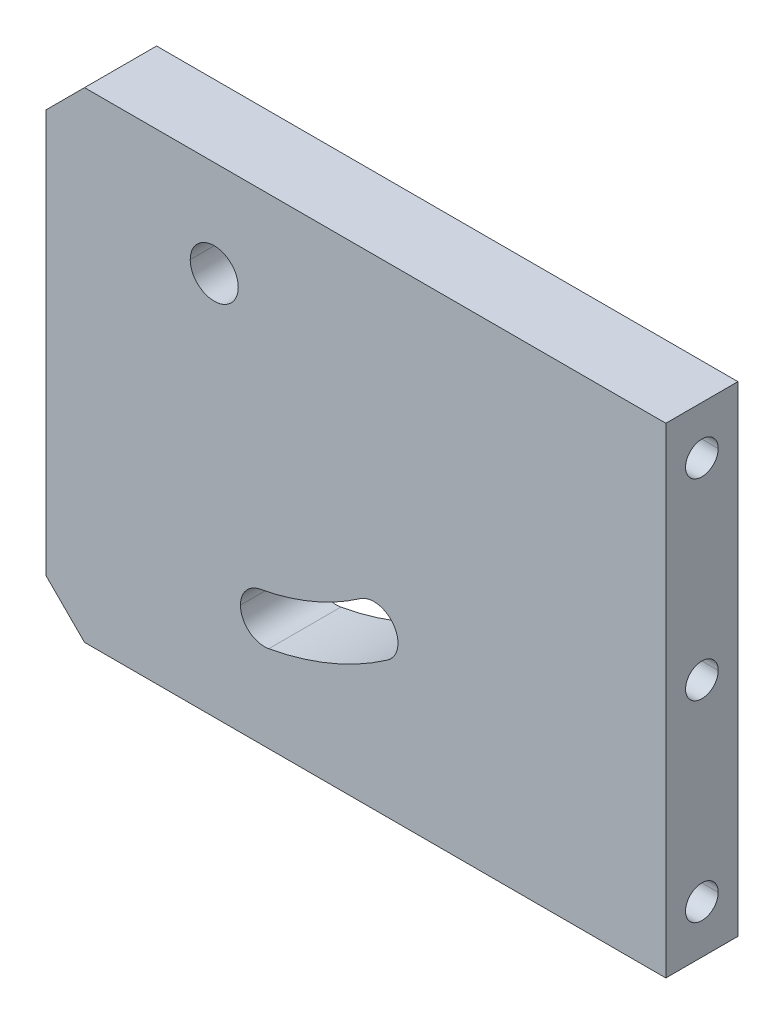
ISO-10303-21;
HEADER;
FILE_DESCRIPTION(('STEP AP214'),'2;1');
FILE_NAME('part.step','',(''),(''),'','','');
FILE_SCHEMA(('AUTOMOTIVE_DESIGN { 1 0 10303 214 1 1 1 1 }'));
ENDSEC;
DATA;
#1=APPLICATION_CONTEXT('core data for automotive mechanical design processes');
#2=APPLICATION_PROTOCOL_DEFINITION('international standard','automotive_design',2000,#1);
#3=PRODUCT_CONTEXT('',#1,'mechanical');
#4=PRODUCT('Part','Part','',(#3));
#5=PRODUCT_RELATED_PRODUCT_CATEGORY('part','',(#4));
#6=PRODUCT_DEFINITION_FORMATION('','',#4);
#7=PRODUCT_DEFINITION_CONTEXT('part definition',#1,'design');
#8=PRODUCT_DEFINITION('design','',#6,#7);
#9=PRODUCT_DEFINITION_SHAPE('','',#8);
#10=(LENGTH_UNIT() NAMED_UNIT(*) SI_UNIT(.MILLI.,.METRE.));
#11=(NAMED_UNIT(*) PLANE_ANGLE_UNIT() SI_UNIT($,.RADIAN.));
#12=(NAMED_UNIT(*) SI_UNIT($,.STERADIAN.) SOLID_ANGLE_UNIT());
#13=UNCERTAINTY_MEASURE_WITH_UNIT(LENGTH_MEASURE(1.E-05),#10,'distance_accuracy_value','');
#14=(GEOMETRIC_REPRESENTATION_CONTEXT(3) GLOBAL_UNCERTAINTY_ASSIGNED_CONTEXT((#13)) GLOBAL_UNIT_ASSIGNED_CONTEXT((#10,
#11,#12)) REPRESENTATION_CONTEXT('',''));
#15=CARTESIAN_POINT('',(0.,0.,0.));
#16=DIRECTION('',(0.,0.,1.));
#17=DIRECTION('',(1.,0.,0.));
#18=AXIS2_PLACEMENT_3D('',#15,#16,#17);
#19=CARTESIAN_POINT('',(64.5,40.,7.5));
#20=DIRECTION('',(1.,0.,0.));
#21=DIRECTION('',(0.,0.,-1.));
#22=AXIS2_PLACEMENT_3D('',#19,#20,#21);
#23=CYLINDRICAL_SURFACE('',#22,3.4);
#24=CARTESIAN_POINT('',(44.5,40.,7.5));
#25=DIRECTION('',(1.,0.,0.));
#26=DIRECTION('',(0.,0.,-1.));
#27=AXIS2_PLACEMENT_3D('',#24,#25,#26);
#28=CIRCLE('',#27,3.4);
#29=CARTESIAN_POINT('',(44.5,40.,10.9));
#30=VERTEX_POINT('',#29);
#31=CARTESIAN_POINT('',(44.5,40.,4.1));
#32=VERTEX_POINT('',#31);
#33=EDGE_CURVE('E41',#30,#32,#28,.T.);
#34=ORIENTED_EDGE('',*,*,#33,.F.);
#35=DIRECTION('',(1.,0.,0.));
#36=VECTOR('',#35,1.);
#37=CARTESIAN_POINT('',(64.5,40.,10.9));
#38=LINE('',#37,#36);
#39=CARTESIAN_POINT('',(64.5,40.,10.9));
#40=VERTEX_POINT('',#39);
#41=EDGE_CURVE('E11',#30,#40,#38,.T.);
#42=ORIENTED_EDGE('',*,*,#41,.T.);
#43=CARTESIAN_POINT('',(64.5,40.,7.5));
#44=DIRECTION('',(1.,0.,0.));
#45=DIRECTION('',(0.,0.,-1.));
#46=AXIS2_PLACEMENT_3D('',#43,#44,#45);
#47=CIRCLE('',#46,3.4);
#48=CARTESIAN_POINT('',(64.5,40.,4.1));
#49=VERTEX_POINT('',#48);
#50=EDGE_CURVE('E28',#40,#49,#47,.T.);
#51=ORIENTED_EDGE('',*,*,#50,.T.);
#52=DIRECTION('',(1.,0.,0.));
#53=VECTOR('',#52,1.);
#54=CARTESIAN_POINT('',(64.5,40.,4.1));
#55=LINE('',#54,#53);
#56=EDGE_CURVE('E302',#32,#49,#55,.T.);
#57=ORIENTED_EDGE('',*,*,#56,.F.);
#58=EDGE_LOOP('',(#34,#42,#51,#57));
#59=FACE_BOUND('',#58,.T.);
#60=ADVANCED_FACE('F18',(#59),#23,.F.);
#61=CARTESIAN_POINT('',(44.5,40.,7.5));
#62=DIRECTION('',(1.,0.,0.));
#63=DIRECTION('',(0.,0.,-1.));
#64=AXIS2_PLACEMENT_3D('',#61,#62,#63);
#65=CONICAL_SURFACE('',#64,3.4,1.02974425867665);
#66=DIRECTION('',(0.515038074910056,0.,-0.857167300702111));
#67=VECTOR('',#66,1.);
#68=CARTESIAN_POINT('',(44.5,40.,4.1));
#69=LINE('',#68,#67);
#70=CARTESIAN_POINT('',(42.4570738953063,40.,7.5));
#71=VERTEX_POINT('',#70);
#72=EDGE_CURVE('E301',#71,#32,#69,.T.);
#73=ORIENTED_EDGE('',*,*,#72,.F.);
#74=DIRECTION('',(0.515038074910056,0.,0.857167300702111));
#75=VECTOR('',#74,1.);
#76=CARTESIAN_POINT('',(44.5,40.,10.9));
#77=LINE('',#76,#75);
#78=EDGE_CURVE('E260',#71,#30,#77,.T.);
#79=ORIENTED_EDGE('',*,*,#78,.T.);
#80=ORIENTED_EDGE('',*,*,#33,.T.);
#81=EDGE_LOOP('',(#73,#79,#80));
#82=FACE_BOUND('',#81,.T.);
#83=ADVANCED_FACE('F470',(#82),#65,.F.);
#84=CARTESIAN_POINT('',(64.5,0.,7.5));
#85=DIRECTION('',(1.,0.,0.));
#86=DIRECTION('',(0.,0.,-1.));
#87=AXIS2_PLACEMENT_3D('',#84,#85,#86);
#88=CYLINDRICAL_SURFACE('',#87,3.4);
#89=CARTESIAN_POINT('',(44.5,0.,7.5));
#90=DIRECTION('',(1.,0.,0.));
#91=DIRECTION('',(0.,0.,-1.));
#92=AXIS2_PLACEMENT_3D('',#89,#90,#91);
#93=CIRCLE('',#92,3.4);
#94=CARTESIAN_POINT('',(44.5,0.,10.9));
#95=VERTEX_POINT('',#94);
#96=CARTESIAN_POINT('',(44.5,0.,4.1));
#97=VERTEX_POINT('',#96);
#98=EDGE_CURVE('E248',#95,#97,#93,.T.);
#99=ORIENTED_EDGE('',*,*,#98,.F.);
#100=DIRECTION('',(1.,0.,0.));
#101=VECTOR('',#100,1.);
#102=CARTESIAN_POINT('',(64.5,0.,10.9));
#103=LINE('',#102,#101);
#104=CARTESIAN_POINT('',(64.5,0.,10.9));
#105=VERTEX_POINT('',#104);
#106=EDGE_CURVE('E363',#95,#105,#103,.T.);
#107=ORIENTED_EDGE('',*,*,#106,.T.);
#108=CARTESIAN_POINT('',(64.5,0.,7.5));
#109=DIRECTION('',(1.,0.,0.));
#110=DIRECTION('',(0.,0.,-1.));
#111=AXIS2_PLACEMENT_3D('',#108,#109,#110);
#112=CIRCLE('',#111,3.4);
#113=CARTESIAN_POINT('',(64.5,0.,4.1));
#114=VERTEX_POINT('',#113);
#115=EDGE_CURVE('E359',#105,#114,#112,.T.);
#116=ORIENTED_EDGE('',*,*,#115,.T.);
#117=DIRECTION('',(1.,0.,0.));
#118=VECTOR('',#117,1.);
#119=CARTESIAN_POINT('',(64.5,0.,4.1));
#120=LINE('',#119,#118);
#121=EDGE_CURVE('E331',#97,#114,#120,.T.);
#122=ORIENTED_EDGE('',*,*,#121,.F.);
#123=EDGE_LOOP('',(#99,#107,#116,#122));
#124=FACE_BOUND('',#123,.T.);
#125=ADVANCED_FACE('F474',(#124),#88,.F.);
#126=CARTESIAN_POINT('',(44.5,0.,7.5));
#127=DIRECTION('',(1.,0.,0.));
#128=DIRECTION('',(0.,0.,-1.));
#129=AXIS2_PLACEMENT_3D('',#126,#127,#128);
#130=CONICAL_SURFACE('',#129,3.4,1.02974425867665);
#131=DIRECTION('',(0.515038074910055,0.,-0.857167300702112));
#132=VECTOR('',#131,1.);
#133=CARTESIAN_POINT('',(44.5,0.,4.1));
#134=LINE('',#133,#132);
#135=CARTESIAN_POINT('',(42.4570738953063,0.,7.5));
#136=VERTEX_POINT('',#135);
#137=EDGE_CURVE('E330',#136,#97,#134,.T.);
#138=ORIENTED_EDGE('',*,*,#137,.F.);
#139=DIRECTION('',(0.515038074910055,0.,0.857167300702112));
#140=VECTOR('',#139,1.);
#141=CARTESIAN_POINT('',(44.5,0.,10.9));
#142=LINE('',#141,#140);
#143=EDGE_CURVE('E364',#136,#95,#142,.T.);
#144=ORIENTED_EDGE('',*,*,#143,.T.);
#145=ORIENTED_EDGE('',*,*,#98,.T.);
#146=EDGE_LOOP('',(#138,#144,#145));
#147=FACE_BOUND('',#146,.T.);
#148=ADVANCED_FACE('F507',(#147),#130,.F.);
#149=CARTESIAN_POINT('',(64.5,-40.,7.5));
#150=DIRECTION('',(1.,0.,0.));
#151=DIRECTION('',(0.,0.,-1.));
#152=AXIS2_PLACEMENT_3D('',#149,#150,#151);
#153=CYLINDRICAL_SURFACE('',#152,3.4);
#154=CARTESIAN_POINT('',(44.5,-40.,7.5));
#155=DIRECTION('',(1.,0.,0.));
#156=DIRECTION('',(0.,0.,-1.));
#157=AXIS2_PLACEMENT_3D('',#154,#155,#156);
#158=CIRCLE('',#157,3.4);
#159=CARTESIAN_POINT('',(44.5,-40.,10.9));
#160=VERTEX_POINT('',#159);
#161=CARTESIAN_POINT('',(44.5,-40.,4.1));
#162=VERTEX_POINT('',#161);
#163=EDGE_CURVE('E213',#160,#162,#158,.T.);
#164=ORIENTED_EDGE('',*,*,#163,.F.);
#165=DIRECTION('',(1.,0.,0.));
#166=VECTOR('',#165,1.);
#167=CARTESIAN_POINT('',(64.5,-40.,10.9));
#168=LINE('',#167,#166);
#169=CARTESIAN_POINT('',(64.5,-40.,10.9));
#170=VERTEX_POINT('',#169);
#171=EDGE_CURVE('E231',#160,#170,#168,.T.);
#172=ORIENTED_EDGE('',*,*,#171,.T.);
#173=CARTESIAN_POINT('',(64.5,-40.,7.5));
#174=DIRECTION('',(1.,0.,0.));
#175=DIRECTION('',(0.,0.,-1.));
#176=AXIS2_PLACEMENT_3D('',#173,#174,#175);
#177=CIRCLE('',#176,3.4);
#178=CARTESIAN_POINT('',(64.5,-40.,4.1));
#179=VERTEX_POINT('',#178);
#180=EDGE_CURVE('E223',#170,#179,#177,.T.);
#181=ORIENTED_EDGE('',*,*,#180,.T.);
#182=DIRECTION('',(1.,0.,0.));
#183=VECTOR('',#182,1.);
#184=CARTESIAN_POINT('',(64.5,-40.,4.1));
#185=LINE('',#184,#183);
#186=EDGE_CURVE('E237',#162,#179,#185,.T.);
#187=ORIENTED_EDGE('',*,*,#186,.F.);
#188=EDGE_LOOP('',(#164,#172,#181,#187));
#189=FACE_BOUND('',#188,.T.);
#190=ADVANCED_FACE('F450',(#189),#153,.F.);
#191=CARTESIAN_POINT('',(44.5,-40.,7.5));
#192=DIRECTION('',(1.,0.,0.));
#193=DIRECTION('',(0.,0.,-1.));
#194=AXIS2_PLACEMENT_3D('',#191,#192,#193);
#195=CONICAL_SURFACE('',#194,3.4,1.02974425867665);
#196=DIRECTION('',(0.515038074910056,0.,-0.857167300702111));
#197=VECTOR('',#196,1.);
#198=CARTESIAN_POINT('',(44.5,-40.,4.1));
#199=LINE('',#198,#197);
#200=CARTESIAN_POINT('',(42.4570738953063,-40.,7.5));
#201=VERTEX_POINT('',#200);
#202=EDGE_CURVE('E208',#201,#162,#199,.T.);
#203=ORIENTED_EDGE('',*,*,#202,.F.);
#204=DIRECTION('',(0.515038074910056,0.,0.857167300702111));
#205=VECTOR('',#204,1.);
#206=CARTESIAN_POINT('',(44.5,-40.,10.9));
#207=LINE('',#206,#205);
#208=EDGE_CURVE('E211',#201,#160,#207,.T.);
#209=ORIENTED_EDGE('',*,*,#208,.T.);
#210=ORIENTED_EDGE('',*,*,#163,.T.);
#211=EDGE_LOOP('',(#203,#209,#210));
#212=FACE_BOUND('',#211,.T.);
#213=ADVANCED_FACE('F210',(#212),#195,.F.);
#214=CARTESIAN_POINT('',(-19.0498034232286,-27.0507965895906,15.));
#215=DIRECTION('',(0.,0.,-1.));
#216=DIRECTION('',(-1.,0.,0.));
#217=AXIS2_PLACEMENT_3D('',#214,#215,#216);
#218=CYLINDRICAL_SURFACE('',#217,5.);
#219=CARTESIAN_POINT('',(-19.0498034232286,-27.0507965895906,15.));
#220=DIRECTION('',(0.,0.,1.));
#221=DIRECTION('',(1.,0.,0.));
#222=AXIS2_PLACEMENT_3D('',#219,#220,#221);
#223=CIRCLE('',#222,5.);
#224=CARTESIAN_POINT('',(-19.9506824384676,-22.1326244697982,15.));
#225=VERTEX_POINT('',#224);
#226=CARTESIAN_POINT('',(-24.0498034232286,-27.0507965895906,15.));
#227=VERTEX_POINT('',#226);
#228=EDGE_CURVE('E233',#225,#227,#223,.T.);
#229=ORIENTED_EDGE('',*,*,#228,.T.);
#230=DIRECTION('',(0.,0.,-1.));
#231=VECTOR('',#230,1.);
#232=CARTESIAN_POINT('',(-24.0498034232286,-27.0507965895906,15.));
#233=LINE('',#232,#231);
#234=CARTESIAN_POINT('',(-24.0498034232286,-27.0507965895906,0.));
#235=VERTEX_POINT('',#234);
#236=EDGE_CURVE('E243',#227,#235,#233,.T.);
#237=ORIENTED_EDGE('',*,*,#236,.T.);
#238=CARTESIAN_POINT('',(-19.0498034232286,-27.0507965895906,0.));
#239=DIRECTION('',(0.,0.,1.));
#240=DIRECTION('',(1.,0.,0.));
#241=AXIS2_PLACEMENT_3D('',#238,#239,#240);
#242=CIRCLE('',#241,5.);
#243=CARTESIAN_POINT('',(-19.9506824384676,-22.1326244697982,0.));
#244=VERTEX_POINT('',#243);
#245=EDGE_CURVE('E292',#244,#235,#242,.T.);
#246=ORIENTED_EDGE('',*,*,#245,.F.);
#247=DIRECTION('',(0.,0.,-1.));
#248=VECTOR('',#247,1.);
#249=CARTESIAN_POINT('',(-19.9506824384676,-22.1326244697982,15.));
#250=LINE('',#249,#248);
#251=EDGE_CURVE('E218',#225,#244,#250,.T.);
#252=ORIENTED_EDGE('',*,*,#251,.F.);
#253=EDGE_LOOP('',(#229,#237,#246,#252));
#254=FACE_BOUND('',#253,.T.);
#255=ADVANCED_FACE('F465',(#254),#218,.F.);
#256=CARTESIAN_POINT('',(-29.5,30.,15.));
#257=DIRECTION('',(0.,0.,-1.));
#258=DIRECTION('',(-1.,0.,0.));
#259=AXIS2_PLACEMENT_3D('',#256,#257,#258);
#260=CYLINDRICAL_SURFACE('',#259,5.);
#261=CARTESIAN_POINT('',(-29.5,30.,15.));
#262=DIRECTION('',(0.,0.,1.));
#263=DIRECTION('',(1.,0.,0.));
#264=AXIS2_PLACEMENT_3D('',#261,#262,#263);
#265=CIRCLE('',#264,5.);
#266=CARTESIAN_POINT('',(-34.5,30.,15.));
#267=VERTEX_POINT('',#266);
#268=CARTESIAN_POINT('',(-24.5,30.,15.));
#269=VERTEX_POINT('',#268);
#270=EDGE_CURVE('E239',#267,#269,#265,.T.);
#271=ORIENTED_EDGE('',*,*,#270,.T.);
#272=DIRECTION('',(0.,0.,-1.));
#273=VECTOR('',#272,1.);
#274=CARTESIAN_POINT('',(-24.5,30.,15.));
#275=LINE('',#274,#273);
#276=CARTESIAN_POINT('',(-24.5,30.,0.));
#277=VERTEX_POINT('',#276);
#278=EDGE_CURVE('E244',#269,#277,#275,.T.);
#279=ORIENTED_EDGE('',*,*,#278,.T.);
#280=CARTESIAN_POINT('',(-29.5,30.,0.));
#281=DIRECTION('',(0.,0.,1.));
#282=DIRECTION('',(1.,0.,0.));
#283=AXIS2_PLACEMENT_3D('',#280,#281,#282);
#284=CIRCLE('',#283,5.);
#285=CARTESIAN_POINT('',(-34.5,30.,0.));
#286=VERTEX_POINT('',#285);
#287=EDGE_CURVE('E273',#286,#277,#284,.T.);
#288=ORIENTED_EDGE('',*,*,#287,.F.);
#289=DIRECTION('',(0.,0.,-1.));
#290=VECTOR('',#289,1.);
#291=CARTESIAN_POINT('',(-34.5,30.,15.));
#292=LINE('',#291,#290);
#293=EDGE_CURVE('E385',#267,#286,#292,.T.);
#294=ORIENTED_EDGE('',*,*,#293,.F.);
#295=EDGE_LOOP('',(#271,#279,#288,#294));
#296=FACE_BOUND('',#295,.T.);
#297=ADVANCED_FACE('F455',(#296),#260,.F.);
#298=CARTESIAN_POINT('',(64.5,-50.,15.));
#299=DIRECTION('',(-1.,0.,0.));
#300=DIRECTION('',(0.,0.,1.));
#301=AXIS2_PLACEMENT_3D('',#298,#299,#300);
#302=PLANE('',#301);
#303=DIRECTION('',(0.,1.,0.));
#304=VECTOR('',#303,1.);
#305=CARTESIAN_POINT('',(64.5,-50.,0.));
#306=LINE('',#305,#304);
#307=CARTESIAN_POINT('',(64.5,-50.,0.));
#308=VERTEX_POINT('',#307);
#309=CARTESIAN_POINT('',(64.5,50.,0.));
#310=VERTEX_POINT('',#309);
#311=EDGE_CURVE('E304',#308,#310,#306,.T.);
#312=ORIENTED_EDGE('',*,*,#311,.T.);
#313=DIRECTION('',(0.,0.,-1.));
#314=VECTOR('',#313,1.);
#315=CARTESIAN_POINT('',(64.5,50.,15.));
#316=LINE('',#315,#314);
#317=CARTESIAN_POINT('',(64.5,50.,15.));
#318=VERTEX_POINT('',#317);
#319=EDGE_CURVE('E316',#318,#310,#316,.T.);
#320=ORIENTED_EDGE('',*,*,#319,.F.);
#321=DIRECTION('',(0.,1.,0.));
#322=VECTOR('',#321,1.);
#323=CARTESIAN_POINT('',(64.5,-50.,15.));
#324=LINE('',#323,#322);
#325=CARTESIAN_POINT('',(64.5,-50.,15.));
#326=VERTEX_POINT('',#325);
#327=EDGE_CURVE('E267',#326,#318,#324,.T.);
#328=ORIENTED_EDGE('',*,*,#327,.F.);
#329=DIRECTION('',(0.,0.,-1.));
#330=VECTOR('',#329,1.);
#331=CARTESIAN_POINT('',(64.5,-50.,15.));
#332=LINE('',#331,#330);
#333=EDGE_CURVE('E307',#326,#308,#332,.T.);
#334=ORIENTED_EDGE('',*,*,#333,.T.);
#335=EDGE_LOOP('',(#312,#320,#328,#334));
#336=FACE_BOUND('',#335,.T.);
#337=CARTESIAN_POINT('',(64.5,40.,7.5));
#338=DIRECTION('',(1.,0.,0.));
#339=DIRECTION('',(0.,0.,-1.));
#340=AXIS2_PLACEMENT_3D('',#337,#338,#339);
#341=CIRCLE('',#340,3.4);
#342=EDGE_CURVE('E372',#49,#40,#341,.T.);
#343=ORIENTED_EDGE('',*,*,#342,.F.);
#344=ORIENTED_EDGE('',*,*,#50,.F.);
#345=EDGE_LOOP('',(#343,#344));
#346=FACE_BOUND('',#345,.T.);
#347=CARTESIAN_POINT('',(64.5,0.,7.5));
#348=DIRECTION('',(1.,0.,0.));
#349=DIRECTION('',(0.,0.,-1.));
#350=AXIS2_PLACEMENT_3D('',#347,#348,#349);
#351=CIRCLE('',#350,3.4);
#352=EDGE_CURVE('E358',#114,#105,#351,.T.);
#353=ORIENTED_EDGE('',*,*,#352,.F.);
#354=ORIENTED_EDGE('',*,*,#115,.F.);
#355=EDGE_LOOP('',(#353,#354));
#356=FACE_BOUND('',#355,.T.);
#357=CARTESIAN_POINT('',(64.5,-40.,7.5));
#358=DIRECTION('',(1.,0.,0.));
#359=DIRECTION('',(0.,0.,-1.));
#360=AXIS2_PLACEMENT_3D('',#357,#358,#359);
#361=CIRCLE('',#360,3.4);
#362=EDGE_CURVE('E421',#179,#170,#361,.T.);
#363=ORIENTED_EDGE('',*,*,#362,.F.);
#364=ORIENTED_EDGE('',*,*,#180,.F.);
#365=EDGE_LOOP('',(#363,#364));
#366=FACE_BOUND('',#365,.T.);
#367=ADVANCED_FACE('F452',(#336,#346,#356,#366),#302,.F.);
#368=CARTESIAN_POINT('',(64.5,50.,15.));
#369=DIRECTION('',(0.,0.,1.));
#370=DIRECTION('',(1.,0.,0.));
#371=AXIS2_PLACEMENT_3D('',#368,#369,#370);
#372=PLANE('',#371);
#373=ORIENTED_EDGE('',*,*,#327,.T.);
#374=DIRECTION('',(-1.,0.,0.));
#375=VECTOR('',#374,1.);
#376=CARTESIAN_POINT('',(64.5,50.,15.));
#377=LINE('',#376,#375);
#378=CARTESIAN_POINT('',(-56.5,50.,15.));
#379=VERTEX_POINT('',#378);
#380=EDGE_CURVE('E264',#318,#379,#377,.T.);
#381=ORIENTED_EDGE('',*,*,#380,.T.);
#382=DIRECTION('',(-0.707106781186548,-0.707106781186548,0.));
#383=VECTOR('',#382,1.);
#384=CARTESIAN_POINT('',(-64.5,42.,15.));
#385=LINE('',#384,#383);
#386=CARTESIAN_POINT('',(-64.5,42.,15.));
#387=VERTEX_POINT('',#386);
#388=EDGE_CURVE('E268',#379,#387,#385,.T.);
#389=ORIENTED_EDGE('',*,*,#388,.T.);
#390=DIRECTION('',(0.,-1.,0.));
#391=VECTOR('',#390,1.);
#392=CARTESIAN_POINT('',(-64.5,-42.,15.));
#393=LINE('',#392,#391);
#394=CARTESIAN_POINT('',(-64.5,-42.,15.));
#395=VERTEX_POINT('',#394);
#396=EDGE_CURVE('E281',#387,#395,#393,.T.);
#397=ORIENTED_EDGE('',*,*,#396,.T.);
#398=DIRECTION('',(0.707106781186548,-0.707106781186547,0.));
#399=VECTOR('',#398,1.);
#400=CARTESIAN_POINT('',(-64.5,-42.,15.));
#401=LINE('',#400,#399);
#402=CARTESIAN_POINT('',(-56.5,-50.,15.));
#403=VERTEX_POINT('',#402);
#404=EDGE_CURVE('E272',#395,#403,#401,.T.);
#405=ORIENTED_EDGE('',*,*,#404,.T.);
#406=DIRECTION('',(1.,0.,0.));
#407=VECTOR('',#406,1.);
#408=CARTESIAN_POINT('',(64.5,-50.,15.));
#409=LINE('',#408,#407);
#410=EDGE_CURVE('E269',#403,#326,#409,.T.);
#411=ORIENTED_EDGE('',*,*,#410,.T.);
#412=EDGE_LOOP('',(#373,#381,#389,#397,#405,#411));
#413=FACE_BOUND('',#412,.T.);
#414=ORIENTED_EDGE('',*,*,#270,.F.);
#415=CARTESIAN_POINT('',(-29.5,30.,15.));
#416=DIRECTION('',(0.,0.,1.));
#417=DIRECTION('',(1.,0.,0.));
#418=AXIS2_PLACEMENT_3D('',#415,#416,#417);
#419=CIRCLE('',#418,5.);
#420=EDGE_CURVE('E388',#269,#267,#419,.T.);
#421=ORIENTED_EDGE('',*,*,#420,.F.);
#422=EDGE_LOOP('',(#414,#421));
#423=FACE_BOUND('',#422,.T.);
#424=CARTESIAN_POINT('',(-29.5,30.,15.));
#425=DIRECTION('',(0.,0.,1.));
#426=DIRECTION('',(1.,0.,0.));
#427=AXIS2_PLACEMENT_3D('',#424,#425,#426);
#428=CIRCLE('',#427,63.);
#429=CARTESIAN_POINT('',(-18.1489244079897,-31.9689687093829,15.));
#430=VERTEX_POINT('',#429);
#431=CARTESIAN_POINT('',(6.60828939653203,-21.6254921221706,15.));
#432=VERTEX_POINT('',#431);
#433=EDGE_CURVE('E332',#430,#432,#428,.T.);
#434=ORIENTED_EDGE('',*,*,#433,.F.);
#435=CARTESIAN_POINT('',(-19.0498034232286,-27.0507965895906,15.));
#436=DIRECTION('',(0.,0.,1.));
#437=DIRECTION('',(1.,0.,0.));
#438=AXIS2_PLACEMENT_3D('',#435,#436,#437);
#439=CIRCLE('',#438,5.);
#440=EDGE_CURVE('E350',#227,#430,#439,.T.);
#441=ORIENTED_EDGE('',*,*,#440,.F.);
#442=ORIENTED_EDGE('',*,*,#228,.F.);
#443=CARTESIAN_POINT('',(-29.5,30.,15.));
#444=DIRECTION('',(0.,0.,-1.));
#445=DIRECTION('',(1.,0.,0.));
#446=AXIS2_PLACEMENT_3D('',#443,#444,#445);
#447=CIRCLE('',#446,53.);
#448=CARTESIAN_POINT('',(0.876814889146,-13.4309695630958,15.));
#449=VERTEX_POINT('',#448);
#450=EDGE_CURVE('E251',#449,#225,#447,.T.);
#451=ORIENTED_EDGE('',*,*,#450,.F.);
#452=CARTESIAN_POINT('',(3.74255214283901,-17.5282308426331,15.));
#453=DIRECTION('',(0.,0.,1.));
#454=DIRECTION('',(1.,0.,0.));
#455=AXIS2_PLACEMENT_3D('',#452,#453,#454);
#456=CIRCLE('',#455,5.);
#457=EDGE_CURVE('E415',#432,#449,#456,.T.);
#458=ORIENTED_EDGE('',*,*,#457,.F.);
#459=EDGE_LOOP('',(#434,#441,#442,#451,#458));
#460=FACE_BOUND('',#459,.T.);
#461=ADVANCED_FACE('F454',(#413,#423,#460),#372,.T.);
#462=CARTESIAN_POINT('',(64.5,50.,0.));
#463=DIRECTION('',(0.,0.,1.));
#464=DIRECTION('',(1.,0.,0.));
#465=AXIS2_PLACEMENT_3D('',#462,#463,#464);
#466=PLANE('',#465);
#467=ORIENTED_EDGE('',*,*,#311,.F.);
#468=DIRECTION('',(1.,0.,0.));
#469=VECTOR('',#468,1.);
#470=CARTESIAN_POINT('',(64.5,-50.,0.));
#471=LINE('',#470,#469);
#472=CARTESIAN_POINT('',(-56.5,-50.,0.));
#473=VERTEX_POINT('',#472);
#474=EDGE_CURVE('E296',#473,#308,#471,.T.);
#475=ORIENTED_EDGE('',*,*,#474,.F.);
#476=DIRECTION('',(0.707106781186548,-0.707106781186547,0.));
#477=VECTOR('',#476,1.);
#478=CARTESIAN_POINT('',(-64.5,-42.,0.));
#479=LINE('',#478,#477);
#480=CARTESIAN_POINT('',(-64.5,-42.,0.));
#481=VERTEX_POINT('',#480);
#482=EDGE_CURVE('E342',#481,#473,#479,.T.);
#483=ORIENTED_EDGE('',*,*,#482,.F.);
#484=DIRECTION('',(0.,-1.,0.));
#485=VECTOR('',#484,1.);
#486=CARTESIAN_POINT('',(-64.5,-42.,0.));
#487=LINE('',#486,#485);
#488=CARTESIAN_POINT('',(-64.5,42.,0.));
#489=VERTEX_POINT('',#488);
#490=EDGE_CURVE('E351',#489,#481,#487,.T.);
#491=ORIENTED_EDGE('',*,*,#490,.F.);
#492=DIRECTION('',(-0.707106781186548,-0.707106781186548,0.));
#493=VECTOR('',#492,1.);
#494=CARTESIAN_POINT('',(-64.5,42.,0.));
#495=LINE('',#494,#493);
#496=CARTESIAN_POINT('',(-56.5,50.,0.));
#497=VERTEX_POINT('',#496);
#498=EDGE_CURVE('E312',#497,#489,#495,.T.);
#499=ORIENTED_EDGE('',*,*,#498,.F.);
#500=DIRECTION('',(-1.,0.,0.));
#501=VECTOR('',#500,1.);
#502=CARTESIAN_POINT('',(64.5,50.,0.));
#503=LINE('',#502,#501);
#504=EDGE_CURVE('E343',#310,#497,#503,.T.);
#505=ORIENTED_EDGE('',*,*,#504,.F.);
#506=EDGE_LOOP('',(#467,#475,#483,#491,#499,#505));
#507=FACE_BOUND('',#506,.T.);
#508=ORIENTED_EDGE('',*,*,#287,.T.);
#509=CARTESIAN_POINT('',(-29.5,30.,0.));
#510=DIRECTION('',(0.,0.,1.));
#511=DIRECTION('',(1.,0.,0.));
#512=AXIS2_PLACEMENT_3D('',#509,#510,#511);
#513=CIRCLE('',#512,5.);
#514=EDGE_CURVE('E283',#277,#286,#513,.T.);
#515=ORIENTED_EDGE('',*,*,#514,.T.);
#516=EDGE_LOOP('',(#508,#515));
#517=FACE_BOUND('',#516,.T.);
#518=ORIENTED_EDGE('',*,*,#245,.T.);
#519=CARTESIAN_POINT('',(-19.0498034232286,-27.0507965895906,0.));
#520=DIRECTION('',(0.,0.,1.));
#521=DIRECTION('',(1.,0.,0.));
#522=AXIS2_PLACEMENT_3D('',#519,#520,#521);
#523=CIRCLE('',#522,5.);
#524=CARTESIAN_POINT('',(-18.1489244079897,-31.9689687093829,0.));
#525=VERTEX_POINT('',#524);
#526=EDGE_CURVE('E325',#235,#525,#523,.T.);
#527=ORIENTED_EDGE('',*,*,#526,.T.);
#528=CARTESIAN_POINT('',(-29.5,30.,0.));
#529=DIRECTION('',(0.,0.,1.));
#530=DIRECTION('',(1.,0.,0.));
#531=AXIS2_PLACEMENT_3D('',#528,#529,#530);
#532=CIRCLE('',#531,63.);
#533=CARTESIAN_POINT('',(6.60828939653203,-21.6254921221706,0.));
#534=VERTEX_POINT('',#533);
#535=EDGE_CURVE('E322',#525,#534,#532,.T.);
#536=ORIENTED_EDGE('',*,*,#535,.T.);
#537=CARTESIAN_POINT('',(3.74255214283901,-17.5282308426331,0.));
#538=DIRECTION('',(0.,0.,1.));
#539=DIRECTION('',(1.,0.,0.));
#540=AXIS2_PLACEMENT_3D('',#537,#538,#539);
#541=CIRCLE('',#540,5.);
#542=CARTESIAN_POINT('',(0.876814889145986,-13.4309695630958,0.));
#543=VERTEX_POINT('',#542);
#544=EDGE_CURVE('E318',#534,#543,#541,.T.);
#545=ORIENTED_EDGE('',*,*,#544,.T.);
#546=CARTESIAN_POINT('',(-29.5,30.,0.));
#547=DIRECTION('',(0.,0.,-1.));
#548=DIRECTION('',(1.,0.,0.));
#549=AXIS2_PLACEMENT_3D('',#546,#547,#548);
#550=CIRCLE('',#549,53.);
#551=EDGE_CURVE('E22',#543,#244,#550,.T.);
#552=ORIENTED_EDGE('',*,*,#551,.T.);
#553=EDGE_LOOP('',(#518,#527,#536,#545,#552));
#554=FACE_BOUND('',#553,.T.);
#555=ADVANCED_FACE('F463',(#507,#517,#554),#466,.F.);
#556=CARTESIAN_POINT('',(64.5,50.,15.));
#557=DIRECTION('',(0.,-1.,0.));
#558=DIRECTION('',(0.,0.,-1.));
#559=AXIS2_PLACEMENT_3D('',#556,#557,#558);
#560=PLANE('',#559);
#561=ORIENTED_EDGE('',*,*,#504,.T.);
#562=DIRECTION('',(0.,0.,-1.));
#563=VECTOR('',#562,1.);
#564=CARTESIAN_POINT('',(-56.5,50.,15.));
#565=LINE('',#564,#563);
#566=EDGE_CURVE('E317',#379,#497,#565,.T.);
#567=ORIENTED_EDGE('',*,*,#566,.F.);
#568=ORIENTED_EDGE('',*,*,#380,.F.);
#569=ORIENTED_EDGE('',*,*,#319,.T.);
#570=EDGE_LOOP('',(#561,#567,#568,#569));
#571=FACE_BOUND('',#570,.T.);
#572=ADVANCED_FACE('F482',(#571),#560,.F.);
#573=CARTESIAN_POINT('',(-64.5,42.,15.));
#574=DIRECTION('',(0.707106781186548,-0.707106781186548,0.));
#575=DIRECTION('',(0.,0.,-1.));
#576=AXIS2_PLACEMENT_3D('',#573,#574,#575);
#577=PLANE('',#576);
#578=ORIENTED_EDGE('',*,*,#498,.T.);
#579=DIRECTION('',(0.,0.,-1.));
#580=VECTOR('',#579,1.);
#581=CARTESIAN_POINT('',(-64.5,42.,15.));
#582=LINE('',#581,#580);
#583=EDGE_CURVE('E355',#387,#489,#582,.T.);
#584=ORIENTED_EDGE('',*,*,#583,.F.);
#585=ORIENTED_EDGE('',*,*,#388,.F.);
#586=ORIENTED_EDGE('',*,*,#566,.T.);
#587=EDGE_LOOP('',(#578,#584,#585,#586));
#588=FACE_BOUND('',#587,.T.);
#589=ADVANCED_FACE('F491',(#588),#577,.F.);
#590=CARTESIAN_POINT('',(-64.5,-42.,15.));
#591=DIRECTION('',(1.,0.,0.));
#592=DIRECTION('',(0.,1.,0.));
#593=AXIS2_PLACEMENT_3D('',#590,#591,#592);
#594=PLANE('',#593);
#595=ORIENTED_EDGE('',*,*,#490,.T.);
#596=DIRECTION('',(0.,0.,-1.));
#597=VECTOR('',#596,1.);
#598=CARTESIAN_POINT('',(-64.5,-42.,15.));
#599=LINE('',#598,#597);
#600=EDGE_CURVE('E338',#395,#481,#599,.T.);
#601=ORIENTED_EDGE('',*,*,#600,.F.);
#602=ORIENTED_EDGE('',*,*,#396,.F.);
#603=ORIENTED_EDGE('',*,*,#583,.T.);
#604=EDGE_LOOP('',(#595,#601,#602,#603));
#605=FACE_BOUND('',#604,.T.);
#606=ADVANCED_FACE('F502',(#605),#594,.F.);
#607=CARTESIAN_POINT('',(-64.5,-42.,15.));
#608=DIRECTION('',(0.707106781186547,0.707106781186548,0.));
#609=DIRECTION('',(0.,0.,-1.));
#610=AXIS2_PLACEMENT_3D('',#607,#608,#609);
#611=PLANE('',#610);
#612=ORIENTED_EDGE('',*,*,#482,.T.);
#613=DIRECTION('',(0.,0.,-1.));
#614=VECTOR('',#613,1.);
#615=CARTESIAN_POINT('',(-56.5,-50.,15.));
#616=LINE('',#615,#614);
#617=EDGE_CURVE('E400',#403,#473,#616,.T.);
#618=ORIENTED_EDGE('',*,*,#617,.F.);
#619=ORIENTED_EDGE('',*,*,#404,.F.);
#620=ORIENTED_EDGE('',*,*,#600,.T.);
#621=EDGE_LOOP('',(#612,#618,#619,#620));
#622=FACE_BOUND('',#621,.T.);
#623=ADVANCED_FACE('F498',(#622),#611,.F.);
#624=CARTESIAN_POINT('',(64.5,-50.,15.));
#625=DIRECTION('',(0.,1.,0.));
#626=DIRECTION('',(1.,0.,0.));
#627=AXIS2_PLACEMENT_3D('',#624,#625,#626);
#628=PLANE('',#627);
#629=ORIENTED_EDGE('',*,*,#474,.T.);
#630=ORIENTED_EDGE('',*,*,#333,.F.);
#631=ORIENTED_EDGE('',*,*,#410,.F.);
#632=ORIENTED_EDGE('',*,*,#617,.T.);
#633=EDGE_LOOP('',(#629,#630,#631,#632));
#634=FACE_BOUND('',#633,.T.);
#635=ADVANCED_FACE('F501',(#634),#628,.F.);
#636=CARTESIAN_POINT('',(-29.5,30.,15.));
#637=DIRECTION('',(0.,0.,-1.));
#638=DIRECTION('',(-1.,0.,0.));
#639=AXIS2_PLACEMENT_3D('',#636,#637,#638);
#640=CYLINDRICAL_SURFACE('',#639,5.);
#641=ORIENTED_EDGE('',*,*,#278,.F.);
#642=ORIENTED_EDGE('',*,*,#420,.T.);
#643=ORIENTED_EDGE('',*,*,#293,.T.);
#644=ORIENTED_EDGE('',*,*,#514,.F.);
#645=EDGE_LOOP('',(#641,#642,#643,#644));
#646=FACE_BOUND('',#645,.T.);
#647=ADVANCED_FACE('F758',(#646),#640,.F.);
#648=CARTESIAN_POINT('',(-19.0498034232286,-27.0507965895906,15.));
#649=DIRECTION('',(0.,0.,-1.));
#650=DIRECTION('',(-1.,0.,0.));
#651=AXIS2_PLACEMENT_3D('',#648,#649,#650);
#652=CYLINDRICAL_SURFACE('',#651,5.);
#653=ORIENTED_EDGE('',*,*,#236,.F.);
#654=ORIENTED_EDGE('',*,*,#440,.T.);
#655=DIRECTION('',(0.,0.,-1.));
#656=VECTOR('',#655,1.);
#657=CARTESIAN_POINT('',(-18.1489244079897,-31.9689687093829,15.));
#658=LINE('',#657,#656);
#659=EDGE_CURVE('E335',#430,#525,#658,.T.);
#660=ORIENTED_EDGE('',*,*,#659,.T.);
#661=ORIENTED_EDGE('',*,*,#526,.F.);
#662=EDGE_LOOP('',(#653,#654,#660,#661));
#663=FACE_BOUND('',#662,.T.);
#664=ADVANCED_FACE('F746',(#663),#652,.F.);
#665=CARTESIAN_POINT('',(-29.5,30.,15.));
#666=DIRECTION('',(0.,0.,-1.));
#667=DIRECTION('',(-1.,0.,0.));
#668=AXIS2_PLACEMENT_3D('',#665,#666,#667);
#669=CYLINDRICAL_SURFACE('',#668,63.);
#670=ORIENTED_EDGE('',*,*,#535,.F.);
#671=ORIENTED_EDGE('',*,*,#659,.F.);
#672=ORIENTED_EDGE('',*,*,#433,.T.);
#673=DIRECTION('',(0.,0.,-1.));
#674=VECTOR('',#673,1.);
#675=CARTESIAN_POINT('',(6.60828939653203,-21.6254921221706,15.));
#676=LINE('',#675,#674);
#677=EDGE_CURVE('E336',#432,#534,#676,.T.);
#678=ORIENTED_EDGE('',*,*,#677,.T.);
#679=EDGE_LOOP('',(#670,#671,#672,#678));
#680=FACE_BOUND('',#679,.T.);
#681=ADVANCED_FACE('F20',(#680),#669,.F.);
#682=CARTESIAN_POINT('',(3.74255214283901,-17.5282308426331,15.));
#683=DIRECTION('',(0.,0.,-1.));
#684=DIRECTION('',(-1.,0.,0.));
#685=AXIS2_PLACEMENT_3D('',#682,#683,#684);
#686=CYLINDRICAL_SURFACE('',#685,5.);
#687=ORIENTED_EDGE('',*,*,#544,.F.);
#688=ORIENTED_EDGE('',*,*,#677,.F.);
#689=ORIENTED_EDGE('',*,*,#457,.T.);
#690=DIRECTION('',(0.,0.,-1.));
#691=VECTOR('',#690,1.);
#692=CARTESIAN_POINT('',(0.876814889145986,-13.4309695630958,15.));
#693=LINE('',#692,#691);
#694=EDGE_CURVE('E255',#449,#543,#693,.T.);
#695=ORIENTED_EDGE('',*,*,#694,.T.);
#696=EDGE_LOOP('',(#687,#688,#689,#695));
#697=FACE_BOUND('',#696,.T.);
#698=ADVANCED_FACE('F524',(#697),#686,.F.);
#699=CARTESIAN_POINT('',(-29.5,30.,15.));
#700=DIRECTION('',(0.,0.,-1.));
#701=DIRECTION('',(-1.,0.,0.));
#702=AXIS2_PLACEMENT_3D('',#699,#700,#701);
#703=CYLINDRICAL_SURFACE('',#702,53.);
#704=ORIENTED_EDGE('',*,*,#551,.F.);
#705=ORIENTED_EDGE('',*,*,#694,.F.);
#706=ORIENTED_EDGE('',*,*,#450,.T.);
#707=ORIENTED_EDGE('',*,*,#251,.T.);
#708=EDGE_LOOP('',(#704,#705,#706,#707));
#709=FACE_BOUND('',#708,.T.);
#710=ADVANCED_FACE('F520',(#709),#703,.T.);
#711=CARTESIAN_POINT('',(44.5,-40.,7.5));
#712=DIRECTION('',(1.,0.,0.));
#713=DIRECTION('',(0.,0.,-1.));
#714=AXIS2_PLACEMENT_3D('',#711,#712,#713);
#715=CONICAL_SURFACE('',#714,3.4,1.02974425867665);
#716=ORIENTED_EDGE('',*,*,#208,.F.);
#717=ORIENTED_EDGE('',*,*,#202,.T.);
#718=CARTESIAN_POINT('',(44.5,-40.,7.5));
#719=DIRECTION('',(1.,0.,0.));
#720=DIRECTION('',(0.,0.,-1.));
#721=AXIS2_PLACEMENT_3D('',#718,#719,#720);
#722=CIRCLE('',#721,3.4);
#723=EDGE_CURVE('E219',#162,#160,#722,.T.);
#724=ORIENTED_EDGE('',*,*,#723,.T.);
#725=EDGE_LOOP('',(#716,#717,#724));
#726=FACE_BOUND('',#725,.T.);
#727=ADVANCED_FACE('F221',(#726),#715,.F.);
#728=CARTESIAN_POINT('',(64.5,-40.,7.5));
#729=DIRECTION('',(1.,0.,0.));
#730=DIRECTION('',(0.,0.,-1.));
#731=AXIS2_PLACEMENT_3D('',#728,#729,#730);
#732=CYLINDRICAL_SURFACE('',#731,3.4);
#733=ORIENTED_EDGE('',*,*,#171,.F.);
#734=ORIENTED_EDGE('',*,*,#723,.F.);
#735=ORIENTED_EDGE('',*,*,#186,.T.);
#736=ORIENTED_EDGE('',*,*,#362,.T.);
#737=EDGE_LOOP('',(#733,#734,#735,#736));
#738=FACE_BOUND('',#737,.T.);
#739=ADVANCED_FACE('F448',(#738),#732,.F.);
#740=CARTESIAN_POINT('',(44.5,0.,7.5));
#741=DIRECTION('',(1.,0.,0.));
#742=DIRECTION('',(0.,0.,-1.));
#743=AXIS2_PLACEMENT_3D('',#740,#741,#742);
#744=CONICAL_SURFACE('',#743,3.4,1.02974425867665);
#745=ORIENTED_EDGE('',*,*,#143,.F.);
#746=ORIENTED_EDGE('',*,*,#137,.T.);
#747=CARTESIAN_POINT('',(44.5,0.,7.5));
#748=DIRECTION('',(1.,0.,0.));
#749=DIRECTION('',(0.,0.,-1.));
#750=AXIS2_PLACEMENT_3D('',#747,#748,#749);
#751=CIRCLE('',#750,3.4);
#752=EDGE_CURVE('E326',#97,#95,#751,.T.);
#753=ORIENTED_EDGE('',*,*,#752,.T.);
#754=EDGE_LOOP('',(#745,#746,#753));
#755=FACE_BOUND('',#754,.T.);
#756=ADVANCED_FACE('F496',(#755),#744,.F.);
#757=CARTESIAN_POINT('',(64.5,0.,7.5));
#758=DIRECTION('',(1.,0.,0.));
#759=DIRECTION('',(0.,0.,-1.));
#760=AXIS2_PLACEMENT_3D('',#757,#758,#759);
#761=CYLINDRICAL_SURFACE('',#760,3.4);
#762=ORIENTED_EDGE('',*,*,#106,.F.);
#763=ORIENTED_EDGE('',*,*,#752,.F.);
#764=ORIENTED_EDGE('',*,*,#121,.T.);
#765=ORIENTED_EDGE('',*,*,#352,.T.);
#766=EDGE_LOOP('',(#762,#763,#764,#765));
#767=FACE_BOUND('',#766,.T.);
#768=ADVANCED_FACE('F493',(#767),#761,.F.);
#769=CARTESIAN_POINT('',(44.5,40.,7.5));
#770=DIRECTION('',(1.,0.,0.));
#771=DIRECTION('',(0.,0.,-1.));
#772=AXIS2_PLACEMENT_3D('',#769,#770,#771);
#773=CONICAL_SURFACE('',#772,3.4,1.02974425867665);
#774=ORIENTED_EDGE('',*,*,#78,.F.);
#775=ORIENTED_EDGE('',*,*,#72,.T.);
#776=CARTESIAN_POINT('',(44.5,40.,7.5));
#777=DIRECTION('',(1.,0.,0.));
#778=DIRECTION('',(0.,0.,-1.));
#779=AXIS2_PLACEMENT_3D('',#776,#777,#778);
#780=CIRCLE('',#779,3.4);
#781=EDGE_CURVE('E298',#32,#30,#780,.T.);
#782=ORIENTED_EDGE('',*,*,#781,.T.);
#783=EDGE_LOOP('',(#774,#775,#782));
#784=FACE_BOUND('',#783,.T.);
#785=ADVANCED_FACE('F487',(#784),#773,.F.);
#786=CARTESIAN_POINT('',(64.5,40.,7.5));
#787=DIRECTION('',(1.,0.,0.));
#788=DIRECTION('',(0.,0.,-1.));
#789=AXIS2_PLACEMENT_3D('',#786,#787,#788);
#790=CYLINDRICAL_SURFACE('',#789,3.4);
#791=ORIENTED_EDGE('',*,*,#41,.F.);
#792=ORIENTED_EDGE('',*,*,#781,.F.);
#793=ORIENTED_EDGE('',*,*,#56,.T.);
#794=ORIENTED_EDGE('',*,*,#342,.T.);
#795=EDGE_LOOP('',(#791,#792,#793,#794));
#796=FACE_BOUND('',#795,.T.);
#797=ADVANCED_FACE('F484',(#796),#790,.F.);
#798=CLOSED_SHELL('',(#60,#83,#125,#148,#190,#213,#255,#297,#367,#461,#555,#572,#589,#606,#623,
#635,#647,#664,#681,#698,#710,#727,#739,#756,#768,#785,#797));
#799=MANIFOLD_SOLID_BREP('B1',#798);
#800=ADVANCED_BREP_SHAPE_REPRESENTATION('',(#18,#799),#14);
#801=SHAPE_DEFINITION_REPRESENTATION(#9,#800);
ENDSEC;
END-ISO-10303-21;
